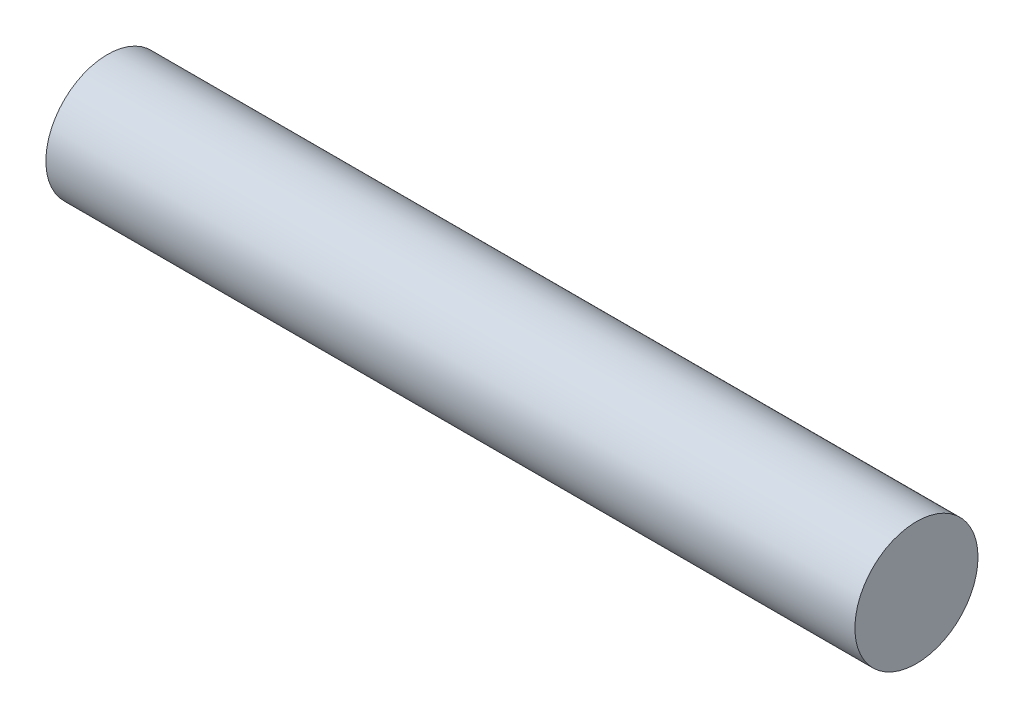
ISO-10303-21;
HEADER;
FILE_DESCRIPTION(('STEP AP214'),'2;1');
FILE_NAME('part.step','',(''),(''),'','','');
FILE_SCHEMA(('AUTOMOTIVE_DESIGN { 1 0 10303 214 1 1 1 1 }'));
ENDSEC;
DATA;
#1=APPLICATION_CONTEXT('core data for automotive mechanical design processes');
#2=APPLICATION_PROTOCOL_DEFINITION('international standard','automotive_design',2000,#1);
#3=PRODUCT_CONTEXT('',#1,'mechanical');
#4=PRODUCT('Part','Part','',(#3));
#5=PRODUCT_RELATED_PRODUCT_CATEGORY('part','',(#4));
#6=PRODUCT_DEFINITION_FORMATION('','',#4);
#7=PRODUCT_DEFINITION_CONTEXT('part definition',#1,'design');
#8=PRODUCT_DEFINITION('design','',#6,#7);
#9=PRODUCT_DEFINITION_SHAPE('','',#8);
#10=(LENGTH_UNIT() NAMED_UNIT(*) SI_UNIT(.MILLI.,.METRE.));
#11=(NAMED_UNIT(*) PLANE_ANGLE_UNIT() SI_UNIT($,.RADIAN.));
#12=(NAMED_UNIT(*) SI_UNIT($,.STERADIAN.) SOLID_ANGLE_UNIT());
#13=UNCERTAINTY_MEASURE_WITH_UNIT(LENGTH_MEASURE(1.E-05),#10,'distance_accuracy_value','');
#14=(GEOMETRIC_REPRESENTATION_CONTEXT(3) GLOBAL_UNCERTAINTY_ASSIGNED_CONTEXT((#13)) GLOBAL_UNIT_ASSIGNED_CONTEXT((#10,
#11,#12)) REPRESENTATION_CONTEXT('',''));
#15=CARTESIAN_POINT('',(0.,0.,0.));
#16=DIRECTION('',(0.,0.,1.));
#17=DIRECTION('',(1.,0.,0.));
#18=AXIS2_PLACEMENT_3D('',#15,#16,#17);
#19=CARTESIAN_POINT('',(73.025,0.,0.));
#20=DIRECTION('',(-1.,0.,0.));
#21=DIRECTION('',(0.,0.,1.));
#22=AXIS2_PLACEMENT_3D('',#19,#20,#21);
#23=CYLINDRICAL_SURFACE('',#22,11.1125);
#24=CARTESIAN_POINT('',(73.025,0.,0.));
#25=DIRECTION('',(1.,0.,0.));
#26=DIRECTION('',(0.,0.,-1.));
#27=AXIS2_PLACEMENT_3D('',#24,#25,#26);
#28=CIRCLE('',#27,11.1125);
#29=CARTESIAN_POINT('',(73.025,0.,-11.1125));
#30=VERTEX_POINT('',#29);
#31=EDGE_CURVE('E10',#30,#30,#28,.T.);
#32=ORIENTED_EDGE('',*,*,#31,.F.);
#33=EDGE_LOOP('',(#32));
#34=FACE_BOUND('',#33,.T.);
#35=CARTESIAN_POINT('',(-73.025,0.,0.));
#36=DIRECTION('',(1.,0.,0.));
#37=DIRECTION('',(0.,0.,-1.));
#38=AXIS2_PLACEMENT_3D('',#35,#36,#37);
#39=CIRCLE('',#38,11.1125);
#40=CARTESIAN_POINT('',(-73.025,0.,-11.1125));
#41=VERTEX_POINT('',#40);
#42=EDGE_CURVE('E33',#41,#41,#39,.T.);
#43=ORIENTED_EDGE('',*,*,#42,.T.);
#44=EDGE_LOOP('',(#43));
#45=FACE_BOUND('',#44,.T.);
#46=ADVANCED_FACE('F30',(#34,#45),#23,.T.);
#47=CARTESIAN_POINT('',(73.025,0.,0.));
#48=DIRECTION('',(1.,0.,0.));
#49=DIRECTION('',(0.,0.,-1.));
#50=AXIS2_PLACEMENT_3D('',#47,#48,#49);
#51=PLANE('',#50);
#52=ORIENTED_EDGE('',*,*,#31,.T.);
#53=EDGE_LOOP('',(#52));
#54=FACE_BOUND('',#53,.T.);
#55=ADVANCED_FACE('F45',(#54),#51,.T.);
#56=CARTESIAN_POINT('',(-73.025,0.,0.));
#57=DIRECTION('',(1.,0.,0.));
#58=DIRECTION('',(0.,0.,-1.));
#59=AXIS2_PLACEMENT_3D('',#56,#57,#58);
#60=PLANE('',#59);
#61=ORIENTED_EDGE('',*,*,#42,.F.);
#62=EDGE_LOOP('',(#61));
#63=FACE_BOUND('',#62,.T.);
#64=ADVANCED_FACE('F43',(#63),#60,.F.);
#65=CLOSED_SHELL('',(#46,#55,#64));
#66=MANIFOLD_SOLID_BREP('B2',#65);
#67=ADVANCED_BREP_SHAPE_REPRESENTATION('',(#18,#66),#14);
#68=SHAPE_DEFINITION_REPRESENTATION(#9,#67);
ENDSEC;
END-ISO-10303-21;
